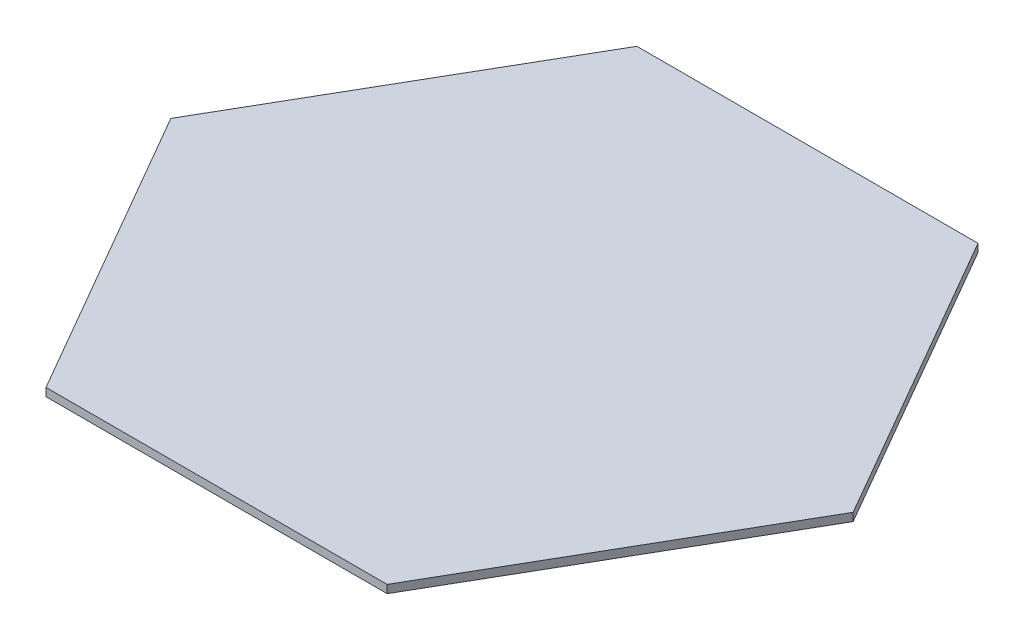
ISO-10303-21;
HEADER;
FILE_DESCRIPTION(('STEP AP214'),'2;1');
FILE_NAME('part.step','',(''),(''),'','','');
FILE_SCHEMA(('AUTOMOTIVE_DESIGN { 1 0 10303 214 1 1 1 1 }'));
ENDSEC;
DATA;
#1=APPLICATION_CONTEXT('core data for automotive mechanical design processes');
#2=APPLICATION_PROTOCOL_DEFINITION('international standard','automotive_design',2000,#1);
#3=PRODUCT_CONTEXT('',#1,'mechanical');
#4=PRODUCT('Part','Part','',(#3));
#5=PRODUCT_RELATED_PRODUCT_CATEGORY('part','',(#4));
#6=PRODUCT_DEFINITION_FORMATION('','',#4);
#7=PRODUCT_DEFINITION_CONTEXT('part definition',#1,'design');
#8=PRODUCT_DEFINITION('design','',#6,#7);
#9=PRODUCT_DEFINITION_SHAPE('','',#8);
#10=(LENGTH_UNIT() NAMED_UNIT(*) SI_UNIT(.MILLI.,.METRE.));
#11=(NAMED_UNIT(*) PLANE_ANGLE_UNIT() SI_UNIT($,.RADIAN.));
#12=(NAMED_UNIT(*) SI_UNIT($,.STERADIAN.) SOLID_ANGLE_UNIT());
#13=UNCERTAINTY_MEASURE_WITH_UNIT(LENGTH_MEASURE(1.E-05),#10,'distance_accuracy_value','');
#14=(GEOMETRIC_REPRESENTATION_CONTEXT(3) GLOBAL_UNCERTAINTY_ASSIGNED_CONTEXT((#13)) GLOBAL_UNIT_ASSIGNED_CONTEXT((#10,
#11,#12)) REPRESENTATION_CONTEXT('',''));
#15=CARTESIAN_POINT('',(0.,0.,0.));
#16=DIRECTION('',(0.,0.,1.));
#17=DIRECTION('',(1.,0.,0.));
#18=AXIS2_PLACEMENT_3D('',#15,#16,#17);
#19=CARTESIAN_POINT('',(-63.5085296108587,3.,110.));
#20=DIRECTION('',(0.,0.,-1.));
#21=DIRECTION('',(-1.,0.,0.));
#22=AXIS2_PLACEMENT_3D('',#19,#20,#21);
#23=PLANE('',#22);
#24=DIRECTION('',(1.,0.,0.));
#25=VECTOR('',#24,1.);
#26=CARTESIAN_POINT('',(-63.5085296108587,0.,110.));
#27=LINE('',#26,#25);
#28=CARTESIAN_POINT('',(-63.5085296108587,0.,110.));
#29=VERTEX_POINT('',#28);
#30=CARTESIAN_POINT('',(63.5085296108588,0.,110.));
#31=VERTEX_POINT('',#30);
#32=EDGE_CURVE('E117',#29,#31,#27,.T.);
#33=ORIENTED_EDGE('',*,*,#32,.T.);
#34=DIRECTION('',(0.,-1.,0.));
#35=VECTOR('',#34,1.);
#36=CARTESIAN_POINT('',(63.5085296108588,3.,110.));
#37=LINE('',#36,#35);
#38=CARTESIAN_POINT('',(63.5085296108588,3.,110.));
#39=VERTEX_POINT('',#38);
#40=EDGE_CURVE('E11',#39,#31,#37,.T.);
#41=ORIENTED_EDGE('',*,*,#40,.F.);
#42=DIRECTION('',(1.,0.,0.));
#43=VECTOR('',#42,1.);
#44=CARTESIAN_POINT('',(-63.5085296108587,3.,110.));
#45=LINE('',#44,#43);
#46=CARTESIAN_POINT('',(-63.5085296108587,3.,110.));
#47=VERTEX_POINT('',#46);
#48=EDGE_CURVE('E127',#47,#39,#45,.T.);
#49=ORIENTED_EDGE('',*,*,#48,.F.);
#50=DIRECTION('',(0.,-1.,0.));
#51=VECTOR('',#50,1.);
#52=CARTESIAN_POINT('',(-63.5085296108587,3.,110.));
#53=LINE('',#52,#51);
#54=EDGE_CURVE('E113',#47,#29,#53,.T.);
#55=ORIENTED_EDGE('',*,*,#54,.T.);
#56=EDGE_LOOP('',(#33,#41,#49,#55));
#57=FACE_BOUND('',#56,.T.);
#58=ADVANCED_FACE('F33',(#57),#23,.F.);
#59=CARTESIAN_POINT('',(63.5085296108588,3.,110.));
#60=DIRECTION('',(-0.866025403784439,0.,-0.5));
#61=DIRECTION('',(-0.5,0.,0.866025403784439));
#62=AXIS2_PLACEMENT_3D('',#59,#60,#61);
#63=PLANE('',#62);
#64=DIRECTION('',(0.5,0.,-0.866025403784439));
#65=VECTOR('',#64,1.);
#66=CARTESIAN_POINT('',(63.5085296108588,0.,110.));
#67=LINE('',#66,#65);
#68=CARTESIAN_POINT('',(127.017059221718,0.,0.));
#69=VERTEX_POINT('',#68);
#70=EDGE_CURVE('E120',#31,#69,#67,.T.);
#71=ORIENTED_EDGE('',*,*,#70,.T.);
#72=DIRECTION('',(0.,-1.,0.));
#73=VECTOR('',#72,1.);
#74=CARTESIAN_POINT('',(127.017059221718,3.,0.));
#75=LINE('',#74,#73);
#76=CARTESIAN_POINT('',(127.017059221718,3.,0.));
#77=VERTEX_POINT('',#76);
#78=EDGE_CURVE('E41',#77,#69,#75,.T.);
#79=ORIENTED_EDGE('',*,*,#78,.F.);
#80=DIRECTION('',(0.5,0.,-0.866025403784439));
#81=VECTOR('',#80,1.);
#82=CARTESIAN_POINT('',(63.5085296108588,3.,110.));
#83=LINE('',#82,#81);
#84=EDGE_CURVE('E86',#39,#77,#83,.T.);
#85=ORIENTED_EDGE('',*,*,#84,.F.);
#86=ORIENTED_EDGE('',*,*,#40,.T.);
#87=EDGE_LOOP('',(#71,#79,#85,#86));
#88=FACE_BOUND('',#87,.T.);
#89=ADVANCED_FACE('F151',(#88),#63,.F.);
#90=CARTESIAN_POINT('',(127.017059221718,3.,0.));
#91=DIRECTION('',(-0.866025403784438,0.,0.5));
#92=DIRECTION('',(0.5,0.,0.866025403784439));
#93=AXIS2_PLACEMENT_3D('',#90,#91,#92);
#94=PLANE('',#93);
#95=DIRECTION('',(-0.5,0.,-0.866025403784438));
#96=VECTOR('',#95,1.);
#97=CARTESIAN_POINT('',(127.017059221718,0.,0.));
#98=LINE('',#97,#96);
#99=CARTESIAN_POINT('',(63.5085296108589,0.,-110.));
#100=VERTEX_POINT('',#99);
#101=EDGE_CURVE('E122',#69,#100,#98,.T.);
#102=ORIENTED_EDGE('',*,*,#101,.T.);
#103=DIRECTION('',(0.,-1.,0.));
#104=VECTOR('',#103,1.);
#105=CARTESIAN_POINT('',(63.5085296108589,3.,-110.));
#106=LINE('',#105,#104);
#107=CARTESIAN_POINT('',(63.5085296108589,3.,-110.));
#108=VERTEX_POINT('',#107);
#109=EDGE_CURVE('E108',#108,#100,#106,.T.);
#110=ORIENTED_EDGE('',*,*,#109,.F.);
#111=DIRECTION('',(-0.5,0.,-0.866025403784438));
#112=VECTOR('',#111,1.);
#113=CARTESIAN_POINT('',(127.017059221718,3.,0.));
#114=LINE('',#113,#112);
#115=EDGE_CURVE('E99',#77,#108,#114,.T.);
#116=ORIENTED_EDGE('',*,*,#115,.F.);
#117=ORIENTED_EDGE('',*,*,#78,.T.);
#118=EDGE_LOOP('',(#102,#110,#116,#117));
#119=FACE_BOUND('',#118,.T.);
#120=ADVANCED_FACE('F133',(#119),#94,.F.);
#121=CARTESIAN_POINT('',(63.5085296108589,3.,-110.));
#122=DIRECTION('',(0.,0.,1.));
#123=DIRECTION('',(1.,0.,0.));
#124=AXIS2_PLACEMENT_3D('',#121,#122,#123);
#125=PLANE('',#124);
#126=DIRECTION('',(-1.,0.,0.));
#127=VECTOR('',#126,1.);
#128=CARTESIAN_POINT('',(63.5085296108589,0.,-110.));
#129=LINE('',#128,#127);
#130=CARTESIAN_POINT('',(-63.5085296108588,0.,-110.));
#131=VERTEX_POINT('',#130);
#132=EDGE_CURVE('E107',#100,#131,#129,.T.);
#133=ORIENTED_EDGE('',*,*,#132,.T.);
#134=DIRECTION('',(0.,-1.,0.));
#135=VECTOR('',#134,1.);
#136=CARTESIAN_POINT('',(-63.5085296108588,3.,-110.));
#137=LINE('',#136,#135);
#138=CARTESIAN_POINT('',(-63.5085296108588,3.,-110.));
#139=VERTEX_POINT('',#138);
#140=EDGE_CURVE('E104',#139,#131,#137,.T.);
#141=ORIENTED_EDGE('',*,*,#140,.F.);
#142=DIRECTION('',(-1.,0.,0.));
#143=VECTOR('',#142,1.);
#144=CARTESIAN_POINT('',(63.5085296108589,3.,-110.));
#145=LINE('',#144,#143);
#146=EDGE_CURVE('E93',#108,#139,#145,.T.);
#147=ORIENTED_EDGE('',*,*,#146,.F.);
#148=ORIENTED_EDGE('',*,*,#109,.T.);
#149=EDGE_LOOP('',(#133,#141,#147,#148));
#150=FACE_BOUND('',#149,.T.);
#151=ADVANCED_FACE('F105',(#150),#125,.F.);
#152=CARTESIAN_POINT('',(-63.5085296108588,3.,-110.));
#153=DIRECTION('',(0.866025403784439,0.,0.5));
#154=DIRECTION('',(0.5,0.,-0.866025403784439));
#155=AXIS2_PLACEMENT_3D('',#152,#153,#154);
#156=PLANE('',#155);
#157=DIRECTION('',(-0.5,0.,0.866025403784438));
#158=VECTOR('',#157,1.);
#159=CARTESIAN_POINT('',(-63.5085296108588,0.,-110.));
#160=LINE('',#159,#158);
#161=CARTESIAN_POINT('',(-127.017059221718,0.,0.));
#162=VERTEX_POINT('',#161);
#163=EDGE_CURVE('E72',#131,#162,#160,.T.);
#164=ORIENTED_EDGE('',*,*,#163,.T.);
#165=DIRECTION('',(0.,-1.,0.));
#166=VECTOR('',#165,1.);
#167=CARTESIAN_POINT('',(-127.017059221718,3.,0.));
#168=LINE('',#167,#166);
#169=CARTESIAN_POINT('',(-127.017059221718,3.,0.));
#170=VERTEX_POINT('',#169);
#171=EDGE_CURVE('E109',#170,#162,#168,.T.);
#172=ORIENTED_EDGE('',*,*,#171,.F.);
#173=DIRECTION('',(-0.5,0.,0.866025403784438));
#174=VECTOR('',#173,1.);
#175=CARTESIAN_POINT('',(-63.5085296108588,3.,-110.));
#176=LINE('',#175,#174);
#177=EDGE_CURVE('E97',#139,#170,#176,.T.);
#178=ORIENTED_EDGE('',*,*,#177,.F.);
#179=ORIENTED_EDGE('',*,*,#140,.T.);
#180=EDGE_LOOP('',(#164,#172,#178,#179));
#181=FACE_BOUND('',#180,.T.);
#182=ADVANCED_FACE('F111',(#181),#156,.F.);
#183=CARTESIAN_POINT('',(-127.017059221718,3.,0.));
#184=DIRECTION('',(0.866025403784438,0.,-0.5));
#185=DIRECTION('',(-0.5,0.,-0.866025403784439));
#186=AXIS2_PLACEMENT_3D('',#183,#184,#185);
#187=PLANE('',#186);
#188=DIRECTION('',(0.5,0.,0.866025403784438));
#189=VECTOR('',#188,1.);
#190=CARTESIAN_POINT('',(-127.017059221718,0.,0.));
#191=LINE('',#190,#189);
#192=EDGE_CURVE('E78',#162,#29,#191,.T.);
#193=ORIENTED_EDGE('',*,*,#192,.T.);
#194=ORIENTED_EDGE('',*,*,#54,.F.);
#195=DIRECTION('',(0.5,0.,0.866025403784438));
#196=VECTOR('',#195,1.);
#197=CARTESIAN_POINT('',(-127.017059221718,3.,0.));
#198=LINE('',#197,#196);
#199=EDGE_CURVE('E49',#170,#47,#198,.T.);
#200=ORIENTED_EDGE('',*,*,#199,.F.);
#201=ORIENTED_EDGE('',*,*,#171,.T.);
#202=EDGE_LOOP('',(#193,#194,#200,#201));
#203=FACE_BOUND('',#202,.T.);
#204=ADVANCED_FACE('F140',(#203),#187,.F.);
#205=CARTESIAN_POINT('',(0.,3.,0.));
#206=DIRECTION('',(0.,1.,0.));
#207=DIRECTION('',(0.,0.,1.));
#208=AXIS2_PLACEMENT_3D('',#205,#206,#207);
#209=PLANE('',#208);
#210=ORIENTED_EDGE('',*,*,#48,.T.);
#211=ORIENTED_EDGE('',*,*,#84,.T.);
#212=ORIENTED_EDGE('',*,*,#115,.T.);
#213=ORIENTED_EDGE('',*,*,#146,.T.);
#214=ORIENTED_EDGE('',*,*,#177,.T.);
#215=ORIENTED_EDGE('',*,*,#199,.T.);
#216=EDGE_LOOP('',(#210,#211,#212,#213,#214,#215));
#217=FACE_BOUND('',#216,.T.);
#218=ADVANCED_FACE('F95',(#217),#209,.T.);
#219=CARTESIAN_POINT('',(0.,0.,0.));
#220=DIRECTION('',(0.,1.,0.));
#221=DIRECTION('',(0.,0.,1.));
#222=AXIS2_PLACEMENT_3D('',#219,#220,#221);
#223=PLANE('',#222);
#224=ORIENTED_EDGE('',*,*,#32,.F.);
#225=ORIENTED_EDGE('',*,*,#192,.F.);
#226=ORIENTED_EDGE('',*,*,#163,.F.);
#227=ORIENTED_EDGE('',*,*,#132,.F.);
#228=ORIENTED_EDGE('',*,*,#101,.F.);
#229=ORIENTED_EDGE('',*,*,#70,.F.);
#230=EDGE_LOOP('',(#224,#225,#226,#227,#228,#229));
#231=FACE_BOUND('',#230,.T.);
#232=ADVANCED_FACE('F136',(#231),#223,.F.);
#233=CLOSED_SHELL('',(#58,#89,#120,#151,#182,#204,#218,#232));
#234=MANIFOLD_SOLID_BREP('B2',#233);
#235=ADVANCED_BREP_SHAPE_REPRESENTATION('',(#18,#234),#14);
#236=SHAPE_DEFINITION_REPRESENTATION(#9,#235);
ENDSEC;
END-ISO-10303-21;
